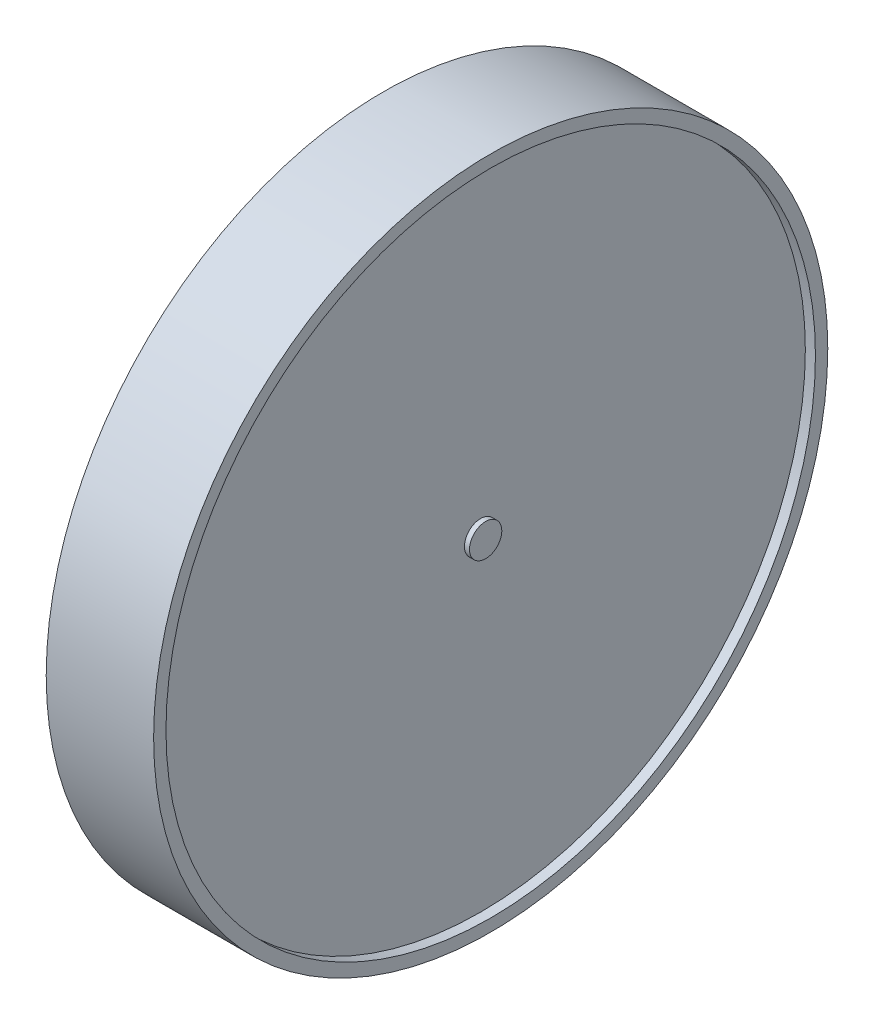
ISO-10303-21;
HEADER;
FILE_DESCRIPTION(('STEP AP214'),'2;1');
FILE_NAME('part.step','',(''),(''),'','','');
FILE_SCHEMA(('AUTOMOTIVE_DESIGN { 1 0 10303 214 1 1 1 1 }'));
ENDSEC;
DATA;
#1=APPLICATION_CONTEXT('core data for automotive mechanical design processes');
#2=APPLICATION_PROTOCOL_DEFINITION('international standard','automotive_design',2000,#1);
#3=PRODUCT_CONTEXT('',#1,'mechanical');
#4=PRODUCT('Part','Part','',(#3));
#5=PRODUCT_RELATED_PRODUCT_CATEGORY('part','',(#4));
#6=PRODUCT_DEFINITION_FORMATION('','',#4);
#7=PRODUCT_DEFINITION_CONTEXT('part definition',#1,'design');
#8=PRODUCT_DEFINITION('design','',#6,#7);
#9=PRODUCT_DEFINITION_SHAPE('','',#8);
#10=(LENGTH_UNIT() NAMED_UNIT(*) SI_UNIT(.MILLI.,.METRE.));
#11=(NAMED_UNIT(*) PLANE_ANGLE_UNIT() SI_UNIT($,.RADIAN.));
#12=(NAMED_UNIT(*) SI_UNIT($,.STERADIAN.) SOLID_ANGLE_UNIT());
#13=UNCERTAINTY_MEASURE_WITH_UNIT(LENGTH_MEASURE(1.E-05),#10,'distance_accuracy_value','');
#14=(GEOMETRIC_REPRESENTATION_CONTEXT(3) GLOBAL_UNCERTAINTY_ASSIGNED_CONTEXT((#13)) GLOBAL_UNIT_ASSIGNED_CONTEXT((#10,
#11,#12)) REPRESENTATION_CONTEXT('',''));
#15=CARTESIAN_POINT('',(0.,0.,0.));
#16=DIRECTION('',(0.,0.,1.));
#17=DIRECTION('',(1.,0.,0.));
#18=AXIS2_PLACEMENT_3D('',#15,#16,#17);
#19=CARTESIAN_POINT('',(43.723144119522,0.,-56.7460102461572));
#20=DIRECTION('',(1.,0.,0.));
#21=DIRECTION('',(0.,0.,-1.));
#22=AXIS2_PLACEMENT_3D('',#19,#20,#21);
#23=CYLINDRICAL_SURFACE('',#22,138.704777407915);
#24=CARTESIAN_POINT('',(41.565871710942,0.,-56.7460102461572));
#25=DIRECTION('',(1.,0.,0.));
#26=DIRECTION('',(0.,0.,-1.));
#27=AXIS2_PLACEMENT_3D('',#24,#25,#26);
#28=CIRCLE('',#27,138.704777407915);
#29=CARTESIAN_POINT('',(41.565871710942,0.,-195.450787654072));
#30=VERTEX_POINT('',#29);
#31=EDGE_CURVE('E53',#30,#30,#28,.T.);
#32=ORIENTED_EDGE('',*,*,#31,.F.);
#33=EDGE_LOOP('',(#32));
#34=FACE_BOUND('',#33,.T.);
#35=CARTESIAN_POINT('',(45.8804165281022,0.,-56.7460102461572));
#36=DIRECTION('',(1.,0.,0.));
#37=DIRECTION('',(0.,0.,-1.));
#38=AXIS2_PLACEMENT_3D('',#35,#36,#37);
#39=CIRCLE('',#38,138.704777407915);
#40=CARTESIAN_POINT('',(45.8804165281022,0.,-195.450787654072));
#41=VERTEX_POINT('',#40);
#42=EDGE_CURVE('E10',#41,#41,#39,.T.);
#43=ORIENTED_EDGE('',*,*,#42,.T.);
#44=EDGE_LOOP('',(#43));
#45=FACE_BOUND('',#44,.T.);
#46=ADVANCED_FACE('F31',(#34,#45),#23,.F.);
#47=CARTESIAN_POINT('',(45.8804165281022,0.,87.2306210820798));
#48=DIRECTION('',(-1.,0.,0.));
#49=DIRECTION('',(0.,0.,1.));
#50=AXIS2_PLACEMENT_3D('',#47,#48,#49);
#51=PLANE('',#50);
#52=ORIENTED_EDGE('',*,*,#42,.F.);
#53=EDGE_LOOP('',(#52));
#54=FACE_BOUND('',#53,.T.);
#55=CARTESIAN_POINT('',(45.8804165281022,0.,-56.7460102461572));
#56=DIRECTION('',(1.,0.,0.));
#57=DIRECTION('',(0.,0.,-1.));
#58=AXIS2_PLACEMENT_3D('',#55,#56,#57);
#59=CIRCLE('',#58,143.976631328237);
#60=CARTESIAN_POINT('',(45.8804165281022,0.,-200.722641574394));
#61=VERTEX_POINT('',#60);
#62=EDGE_CURVE('E37',#61,#61,#59,.T.);
#63=ORIENTED_EDGE('',*,*,#62,.T.);
#64=EDGE_LOOP('',(#63));
#65=FACE_BOUND('',#64,.T.);
#66=ADVANCED_FACE('F60',(#54,#65),#51,.F.);
#67=CARTESIAN_POINT('',(43.723144119522,0.,-56.7460102461572));
#68=DIRECTION('',(1.,0.,0.));
#69=DIRECTION('',(0.,0.,-1.));
#70=AXIS2_PLACEMENT_3D('',#67,#68,#69);
#71=CYLINDRICAL_SURFACE('',#70,143.976631328237);
#72=ORIENTED_EDGE('',*,*,#62,.F.);
#73=EDGE_LOOP('',(#72));
#74=FACE_BOUND('',#73,.T.);
#75=CARTESIAN_POINT('',(0.,0.,-56.7460102461572));
#76=DIRECTION('',(1.,0.,0.));
#77=DIRECTION('',(0.,0.,-1.));
#78=AXIS2_PLACEMENT_3D('',#75,#76,#77);
#79=CIRCLE('',#78,143.976631328237);
#80=CARTESIAN_POINT('',(0.,0.,-200.722641574394));
#81=VERTEX_POINT('',#80);
#82=EDGE_CURVE('E41',#81,#81,#79,.T.);
#83=ORIENTED_EDGE('',*,*,#82,.T.);
#84=EDGE_LOOP('',(#83));
#85=FACE_BOUND('',#84,.T.);
#86=ADVANCED_FACE('F64',(#74,#85),#71,.T.);
#87=CARTESIAN_POINT('',(0.,0.,-49.8506068504581));
#88=DIRECTION('',(1.,0.,0.));
#89=DIRECTION('',(0.,0.,-1.));
#90=AXIS2_PLACEMENT_3D('',#87,#88,#89);
#91=PLANE('',#90);
#92=ORIENTED_EDGE('',*,*,#82,.F.);
#93=EDGE_LOOP('',(#92));
#94=FACE_BOUND('',#93,.T.);
#95=ADVANCED_FACE('F69',(#94),#91,.F.);
#96=CARTESIAN_POINT('',(43.723144119522,0.,-49.8506068504581));
#97=DIRECTION('',(-1.,0.,0.));
#98=DIRECTION('',(0.,0.,1.));
#99=AXIS2_PLACEMENT_3D('',#96,#97,#98);
#100=PLANE('',#99);
#101=CARTESIAN_POINT('',(43.723144119522,0.,-56.7460102461572));
#102=DIRECTION('',(1.,0.,0.));
#103=DIRECTION('',(0.,0.,-1.));
#104=AXIS2_PLACEMENT_3D('',#101,#102,#103);
#105=CIRCLE('',#104,6.89540339569915);
#106=CARTESIAN_POINT('',(43.723144119522,0.,-63.6414136418564));
#107=VERTEX_POINT('',#106);
#108=EDGE_CURVE('E45',#107,#107,#105,.T.);
#109=ORIENTED_EDGE('',*,*,#108,.T.);
#110=EDGE_LOOP('',(#109));
#111=FACE_BOUND('',#110,.T.);
#112=ADVANCED_FACE('F75',(#111),#100,.F.);
#113=CARTESIAN_POINT('',(43.723144119522,0.,-56.7460102461572));
#114=DIRECTION('',(1.,0.,0.));
#115=DIRECTION('',(0.,0.,-1.));
#116=AXIS2_PLACEMENT_3D('',#113,#114,#115);
#117=CYLINDRICAL_SURFACE('',#116,6.89540339569915);
#118=ORIENTED_EDGE('',*,*,#108,.F.);
#119=EDGE_LOOP('',(#118));
#120=FACE_BOUND('',#119,.T.);
#121=CARTESIAN_POINT('',(41.5658717109419,0.,-56.7460102461572));
#122=DIRECTION('',(1.,0.,0.));
#123=DIRECTION('',(0.,0.,-1.));
#124=AXIS2_PLACEMENT_3D('',#121,#122,#123);
#125=CIRCLE('',#124,6.89540339569915);
#126=CARTESIAN_POINT('',(41.5658717109419,0.,-63.6414136418564));
#127=VERTEX_POINT('',#126);
#128=EDGE_CURVE('E50',#127,#127,#125,.T.);
#129=ORIENTED_EDGE('',*,*,#128,.T.);
#130=EDGE_LOOP('',(#129));
#131=FACE_BOUND('',#130,.T.);
#132=ADVANCED_FACE('F79',(#120,#131),#117,.T.);
#133=CARTESIAN_POINT('',(41.5658717109419,0.,81.9587671617574));
#134=DIRECTION('',(-1.,0.,0.));
#135=DIRECTION('',(0.,0.,1.));
#136=AXIS2_PLACEMENT_3D('',#133,#134,#135);
#137=PLANE('',#136);
#138=ORIENTED_EDGE('',*,*,#128,.F.);
#139=EDGE_LOOP('',(#138));
#140=FACE_BOUND('',#139,.T.);
#141=ORIENTED_EDGE('',*,*,#31,.T.);
#142=EDGE_LOOP('',(#141));
#143=FACE_BOUND('',#142,.T.);
#144=ADVANCED_FACE('F57',(#140,#143),#137,.F.);
#145=CLOSED_SHELL('',(#46,#66,#86,#95,#112,#132,#144));
#146=MANIFOLD_SOLID_BREP('B2',#145);
#147=ADVANCED_BREP_SHAPE_REPRESENTATION('',(#18,#146),#14);
#148=SHAPE_DEFINITION_REPRESENTATION(#9,#147);
ENDSEC;
END-ISO-10303-21;
